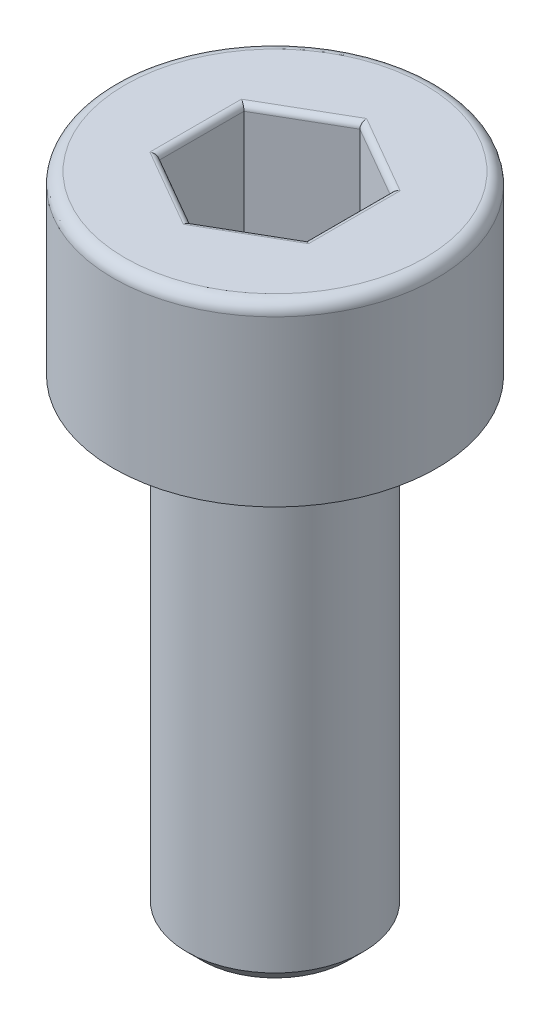
ISO-10303-21;
HEADER;
FILE_DESCRIPTION(('STEP AP214'),'2;1');
FILE_NAME('part.step','',(''),(''),'','','');
FILE_SCHEMA(('AUTOMOTIVE_DESIGN { 1 0 10303 214 1 1 1 1 }'));
ENDSEC;
DATA;
#1=APPLICATION_CONTEXT('core data for automotive mechanical design processes');
#2=APPLICATION_PROTOCOL_DEFINITION('international standard','automotive_design',2000,#1);
#3=PRODUCT_CONTEXT('',#1,'mechanical');
#4=PRODUCT('Part','Part','',(#3));
#5=PRODUCT_RELATED_PRODUCT_CATEGORY('part','',(#4));
#6=PRODUCT_DEFINITION_FORMATION('','',#4);
#7=PRODUCT_DEFINITION_CONTEXT('part definition',#1,'design');
#8=PRODUCT_DEFINITION('design','',#6,#7);
#9=PRODUCT_DEFINITION_SHAPE('','',#8);
#10=(LENGTH_UNIT() NAMED_UNIT(*) SI_UNIT(.MILLI.,.METRE.));
#11=(NAMED_UNIT(*) PLANE_ANGLE_UNIT() SI_UNIT($,.RADIAN.));
#12=(NAMED_UNIT(*) SI_UNIT($,.STERADIAN.) SOLID_ANGLE_UNIT());
#13=UNCERTAINTY_MEASURE_WITH_UNIT(LENGTH_MEASURE(1.E-05),#10,'distance_accuracy_value','');
#14=(GEOMETRIC_REPRESENTATION_CONTEXT(3) GLOBAL_UNCERTAINTY_ASSIGNED_CONTEXT((#13)) GLOBAL_UNIT_ASSIGNED_CONTEXT((#10,
#11,#12)) REPRESENTATION_CONTEXT('',''));
#15=CARTESIAN_POINT('',(0.,0.,0.));
#16=DIRECTION('',(0.,0.,1.));
#17=DIRECTION('',(1.,0.,0.));
#18=AXIS2_PLACEMENT_3D('',#15,#16,#17);
#19=CARTESIAN_POINT('',(0.,-11.,0.));
#20=DIRECTION('',(0.,-1.,0.));
#21=DIRECTION('',(0.,0.,-1.));
#22=AXIS2_PLACEMENT_3D('',#19,#20,#21);
#23=PLANE('',#22);
#24=CARTESIAN_POINT('',(0.,-11.,0.));
#25=DIRECTION('',(0.,-1.,0.));
#26=DIRECTION('',(0.,0.,-1.));
#27=AXIS2_PLACEMENT_3D('',#24,#25,#26);
#28=CIRCLE('',#27,1.25);
#29=CARTESIAN_POINT('',(0.,-11.,-1.25));
#30=VERTEX_POINT('',#29);
#31=EDGE_CURVE('E263',#30,#30,#28,.T.);
#32=ORIENTED_EDGE('',*,*,#31,.T.);
#33=EDGE_LOOP('',(#32));
#34=FACE_BOUND('',#33,.T.);
#35=ADVANCED_FACE('F35',(#34),#23,.T.);
#36=CARTESIAN_POINT('',(0.,0.,0.));
#37=DIRECTION('',(0.,1.,0.));
#38=DIRECTION('',(0.,0.,1.));
#39=AXIS2_PLACEMENT_3D('',#36,#37,#38);
#40=CYLINDRICAL_SURFACE('',#39,1.5);
#41=CARTESIAN_POINT('',(0.,-3.25,0.));
#42=DIRECTION('',(0.,-1.,0.));
#43=DIRECTION('',(0.,0.,-1.));
#44=AXIS2_PLACEMENT_3D('',#41,#42,#43);
#45=CIRCLE('',#44,1.5);
#46=CARTESIAN_POINT('',(0.,-3.25,-1.5));
#47=VERTEX_POINT('',#46);
#48=EDGE_CURVE('E260',#47,#47,#45,.T.);
#49=ORIENTED_EDGE('',*,*,#48,.T.);
#50=EDGE_LOOP('',(#49));
#51=FACE_BOUND('',#50,.T.);
#52=CARTESIAN_POINT('',(0.,-10.75,0.));
#53=DIRECTION('',(0.,-1.,0.));
#54=DIRECTION('',(0.,0.,-1.));
#55=AXIS2_PLACEMENT_3D('',#52,#53,#54);
#56=CIRCLE('',#55,1.5);
#57=CARTESIAN_POINT('',(0.,-10.75,-1.5));
#58=VERTEX_POINT('',#57);
#59=EDGE_CURVE('E257',#58,#58,#56,.F.);
#60=ORIENTED_EDGE('',*,*,#59,.T.);
#61=EDGE_LOOP('',(#60));
#62=FACE_BOUND('',#61,.T.);
#63=ADVANCED_FACE('F289',(#51,#62),#40,.T.);
#64=CARTESIAN_POINT('',(-1.5,-3.,0.));
#65=DIRECTION('',(0.,-1.,0.));
#66=DIRECTION('',(0.,0.,-1.));
#67=AXIS2_PLACEMENT_3D('',#64,#65,#66);
#68=PLANE('',#67);
#69=CARTESIAN_POINT('',(0.,-3.,0.));
#70=DIRECTION('',(0.,-1.,0.));
#71=DIRECTION('',(0.,0.,-1.));
#72=AXIS2_PLACEMENT_3D('',#69,#70,#71);
#73=CIRCLE('',#72,1.75);
#74=CARTESIAN_POINT('',(0.,-3.,-1.75));
#75=VERTEX_POINT('',#74);
#76=EDGE_CURVE('E254',#75,#75,#73,.F.);
#77=ORIENTED_EDGE('',*,*,#76,.T.);
#78=EDGE_LOOP('',(#77));
#79=FACE_BOUND('',#78,.T.);
#80=CARTESIAN_POINT('',(0.,-3.,0.));
#81=DIRECTION('',(0.,1.,0.));
#82=DIRECTION('',(0.,0.,1.));
#83=AXIS2_PLACEMENT_3D('',#80,#81,#82);
#84=CIRCLE('',#83,2.75);
#85=CARTESIAN_POINT('',(0.,-3.,2.75));
#86=VERTEX_POINT('',#85);
#87=EDGE_CURVE('E251',#86,#86,#84,.T.);
#88=ORIENTED_EDGE('',*,*,#87,.F.);
#89=EDGE_LOOP('',(#88));
#90=FACE_BOUND('',#89,.T.);
#91=ADVANCED_FACE('F295',(#79,#90),#68,.T.);
#92=CARTESIAN_POINT('',(0.,0.,0.));
#93=DIRECTION('',(0.,1.,0.));
#94=DIRECTION('',(0.,0.,1.));
#95=AXIS2_PLACEMENT_3D('',#92,#93,#94);
#96=CYLINDRICAL_SURFACE('',#95,2.75);
#97=CARTESIAN_POINT('',(0.,-0.2,0.));
#98=DIRECTION('',(0.,1.,0.));
#99=DIRECTION('',(0.,0.,1.));
#100=AXIS2_PLACEMENT_3D('',#97,#98,#99);
#101=CIRCLE('',#100,2.75);
#102=CARTESIAN_POINT('',(0.,-0.2,2.75));
#103=VERTEX_POINT('',#102);
#104=EDGE_CURVE('E161',#103,#103,#101,.F.);
#105=ORIENTED_EDGE('',*,*,#104,.T.);
#106=EDGE_LOOP('',(#105));
#107=FACE_BOUND('',#106,.T.);
#108=ORIENTED_EDGE('',*,*,#87,.T.);
#109=EDGE_LOOP('',(#108));
#110=FACE_BOUND('',#109,.T.);
#111=ADVANCED_FACE('F305',(#107,#110),#96,.T.);
#112=CARTESIAN_POINT('',(-2.75,0.,0.));
#113=DIRECTION('',(0.,1.,0.));
#114=DIRECTION('',(0.,0.,1.));
#115=AXIS2_PLACEMENT_3D('',#112,#113,#114);
#116=PLANE('',#115);
#117=DIRECTION('',(0.,0.,1.));
#118=VECTOR('',#117,1.);
#119=CARTESIAN_POINT('',(-1.35,0.,-0.721687836487033));
#120=LINE('',#119,#118);
#121=CARTESIAN_POINT('',(-1.35,0.,0.779422863405995));
#122=VERTEX_POINT('',#121);
#123=CARTESIAN_POINT('',(-1.35,0.,-0.779422863405995));
#124=VERTEX_POINT('',#123);
#125=EDGE_CURVE('E177',#122,#124,#120,.F.);
#126=ORIENTED_EDGE('',*,*,#125,.T.);
#127=DIRECTION('',(-0.866025403784439,0.,0.5));
#128=VECTOR('',#127,1.);
#129=CARTESIAN_POINT('',(-0.0500000000000002,0.,-1.52997821335251));
#130=LINE('',#129,#128);
#131=CARTESIAN_POINT('',(0.,0.,-1.55884572681199));
#132=VERTEX_POINT('',#131);
#133=EDGE_CURVE('E136',#124,#132,#130,.F.);
#134=ORIENTED_EDGE('',*,*,#133,.T.);
#135=DIRECTION('',(-0.866025403784439,0.,-0.5));
#136=VECTOR('',#135,1.);
#137=CARTESIAN_POINT('',(1.3,0.,-0.808290376865477));
#138=LINE('',#137,#136);
#139=CARTESIAN_POINT('',(1.35,0.,-0.779422863405995));
#140=VERTEX_POINT('',#139);
#141=EDGE_CURVE('E163',#132,#140,#138,.F.);
#142=ORIENTED_EDGE('',*,*,#141,.T.);
#143=DIRECTION('',(0.,0.,-1.));
#144=VECTOR('',#143,1.);
#145=CARTESIAN_POINT('',(1.35,0.,0.721687836487034));
#146=LINE('',#145,#144);
#147=CARTESIAN_POINT('',(1.35,0.,0.779422863405996));
#148=VERTEX_POINT('',#147);
#149=EDGE_CURVE('E171',#140,#148,#146,.F.);
#150=ORIENTED_EDGE('',*,*,#149,.T.);
#151=DIRECTION('',(0.866025403784439,0.,-0.5));
#152=VECTOR('',#151,1.);
#153=CARTESIAN_POINT('',(0.05,0.,1.52997821335251));
#154=LINE('',#153,#152);
#155=CARTESIAN_POINT('',(0.,0.,1.55884572681199));
#156=VERTEX_POINT('',#155);
#157=EDGE_CURVE('E173',#148,#156,#154,.F.);
#158=ORIENTED_EDGE('',*,*,#157,.T.);
#159=DIRECTION('',(0.866025403784438,0.,0.5));
#160=VECTOR('',#159,1.);
#161=CARTESIAN_POINT('',(-1.3,0.,0.808290376865476));
#162=LINE('',#161,#160);
#163=EDGE_CURVE('E175',#156,#122,#162,.F.);
#164=ORIENTED_EDGE('',*,*,#163,.T.);
#165=EDGE_LOOP('',(#126,#134,#142,#150,#158,#164));
#166=FACE_BOUND('',#165,.T.);
#167=CARTESIAN_POINT('',(0.,0.,0.));
#168=DIRECTION('',(0.,1.,0.));
#169=DIRECTION('',(0.,0.,1.));
#170=AXIS2_PLACEMENT_3D('',#167,#168,#169);
#171=CIRCLE('',#170,2.55);
#172=CARTESIAN_POINT('',(0.,0.,2.55));
#173=VERTEX_POINT('',#172);
#174=EDGE_CURVE('E166',#173,#173,#171,.T.);
#175=ORIENTED_EDGE('',*,*,#174,.T.);
#176=EDGE_LOOP('',(#175));
#177=FACE_BOUND('',#176,.T.);
#178=ADVANCED_FACE('F268',(#166,#177),#116,.T.);
#179=CARTESIAN_POINT('',(0.,-3.,0.));
#180=DIRECTION('',(0.,1.,0.));
#181=DIRECTION('',(0.,0.,1.));
#182=AXIS2_PLACEMENT_3D('',#179,#180,#181);
#183=CONICAL_SURFACE('',#182,1.75,0.785398163397455);
#184=ORIENTED_EDGE('',*,*,#48,.F.);
#185=EDGE_LOOP('',(#184));
#186=FACE_BOUND('',#185,.T.);
#187=ORIENTED_EDGE('',*,*,#76,.F.);
#188=EDGE_LOOP('',(#187));
#189=FACE_BOUND('',#188,.T.);
#190=ADVANCED_FACE('F283',(#186,#189),#183,.T.);
#191=CARTESIAN_POINT('',(0.,-10.75,0.));
#192=DIRECTION('',(0.,1.,0.));
#193=DIRECTION('',(0.,0.,1.));
#194=AXIS2_PLACEMENT_3D('',#191,#192,#193);
#195=CONICAL_SURFACE('',#194,1.5,0.785398163397451);
#196=ORIENTED_EDGE('',*,*,#31,.F.);
#197=EDGE_LOOP('',(#196));
#198=FACE_BOUND('',#197,.T.);
#199=ORIENTED_EDGE('',*,*,#59,.F.);
#200=EDGE_LOOP('',(#199));
#201=FACE_BOUND('',#200,.T.);
#202=ADVANCED_FACE('F273',(#198,#201),#195,.T.);
#203=CARTESIAN_POINT('',(0.,-0.2,0.));
#204=DIRECTION('',(0.,1.,0.));
#205=DIRECTION('',(0.,0.,1.));
#206=AXIS2_PLACEMENT_3D('',#203,#204,#205);
#207=TOROIDAL_SURFACE('',#206,2.55,0.2);
#208=ORIENTED_EDGE('',*,*,#104,.F.);
#209=EDGE_LOOP('',(#208));
#210=FACE_BOUND('',#209,.T.);
#211=ORIENTED_EDGE('',*,*,#174,.F.);
#212=EDGE_LOOP('',(#211));
#213=FACE_BOUND('',#212,.T.);
#214=ADVANCED_FACE('F270',(#210,#213),#207,.T.);
#215=CARTESIAN_POINT('',(1.25,-2.,-0.721687836487033));
#216=DIRECTION('',(0.5,0.,-0.866025403784439));
#217=DIRECTION('',(-0.866025403784439,0.,-0.5));
#218=AXIS2_PLACEMENT_3D('',#215,#216,#217);
#219=PLANE('',#218);
#220=DIRECTION('',(0.,1.,0.));
#221=VECTOR('',#220,1.);
#222=CARTESIAN_POINT('',(1.25,-2.,-0.721687836487033));
#223=LINE('',#222,#221);
#224=CARTESIAN_POINT('',(1.25,-1.9,-0.721687836487033));
#225=VERTEX_POINT('',#224);
#226=CARTESIAN_POINT('',(1.25,-0.1,-0.721687836487033));
#227=VERTEX_POINT('',#226);
#228=EDGE_CURVE('E245',#225,#227,#223,.T.);
#229=ORIENTED_EDGE('',*,*,#228,.T.);
#230=DIRECTION('',(-0.866025403784439,0.,-0.5));
#231=VECTOR('',#230,1.);
#232=CARTESIAN_POINT('',(0.,-0.1,-1.44337567297406));
#233=LINE('',#232,#231);
#234=CARTESIAN_POINT('',(0.,-0.1,-1.44337567297406));
#235=VERTEX_POINT('',#234);
#236=EDGE_CURVE('E197',#227,#235,#233,.T.);
#237=ORIENTED_EDGE('',*,*,#236,.T.);
#238=DIRECTION('',(0.,1.,0.));
#239=VECTOR('',#238,1.);
#240=CARTESIAN_POINT('',(0.,-2.,-1.44337567297406));
#241=LINE('',#240,#239);
#242=CARTESIAN_POINT('',(0.,-1.9,-1.44337567297406));
#243=VERTEX_POINT('',#242);
#244=EDGE_CURVE('E147',#243,#235,#241,.T.);
#245=ORIENTED_EDGE('',*,*,#244,.F.);
#246=DIRECTION('',(-0.866025403784439,0.,-0.5));
#247=VECTOR('',#246,1.);
#248=CARTESIAN_POINT('',(1.25,-1.9,-0.721687836487033));
#249=LINE('',#248,#247);
#250=EDGE_CURVE('E195',#243,#225,#249,.F.);
#251=ORIENTED_EDGE('',*,*,#250,.T.);
#252=EDGE_LOOP('',(#229,#237,#245,#251));
#253=FACE_BOUND('',#252,.T.);
#254=ADVANCED_FACE('F272',(#253),#219,.F.);
#255=CARTESIAN_POINT('',(1.25,-2.,0.721687836487034));
#256=DIRECTION('',(1.,0.,0.));
#257=DIRECTION('',(0.,0.,-1.));
#258=AXIS2_PLACEMENT_3D('',#255,#256,#257);
#259=PLANE('',#258);
#260=DIRECTION('',(0.,1.,0.));
#261=VECTOR('',#260,1.);
#262=CARTESIAN_POINT('',(1.25,-2.,0.721687836487034));
#263=LINE('',#262,#261);
#264=CARTESIAN_POINT('',(1.25,-1.9,0.721687836487034));
#265=VERTEX_POINT('',#264);
#266=CARTESIAN_POINT('',(1.25,-0.1,0.721687836487034));
#267=VERTEX_POINT('',#266);
#268=EDGE_CURVE('E242',#265,#267,#263,.T.);
#269=ORIENTED_EDGE('',*,*,#268,.T.);
#270=DIRECTION('',(0.,0.,-1.));
#271=VECTOR('',#270,1.);
#272=CARTESIAN_POINT('',(1.25,-0.1,-0.721687836487033));
#273=LINE('',#272,#271);
#274=EDGE_CURVE('E193',#267,#227,#273,.T.);
#275=ORIENTED_EDGE('',*,*,#274,.T.);
#276=ORIENTED_EDGE('',*,*,#228,.F.);
#277=DIRECTION('',(0.,0.,-1.));
#278=VECTOR('',#277,1.);
#279=CARTESIAN_POINT('',(1.25,-1.9,0.721687836487034));
#280=LINE('',#279,#278);
#281=EDGE_CURVE('E190',#225,#265,#280,.F.);
#282=ORIENTED_EDGE('',*,*,#281,.T.);
#283=EDGE_LOOP('',(#269,#275,#276,#282));
#284=FACE_BOUND('',#283,.T.);
#285=ADVANCED_FACE('F280',(#284),#259,.F.);
#286=CARTESIAN_POINT('',(0.,-2.,1.44337567297407));
#287=DIRECTION('',(0.5,0.,0.866025403784439));
#288=DIRECTION('',(0.866025403784439,0.,-0.5));
#289=AXIS2_PLACEMENT_3D('',#286,#287,#288);
#290=PLANE('',#289);
#291=DIRECTION('',(0.,1.,0.));
#292=VECTOR('',#291,1.);
#293=CARTESIAN_POINT('',(0.,-2.,1.44337567297407));
#294=LINE('',#293,#292);
#295=CARTESIAN_POINT('',(0.,-1.9,1.44337567297407));
#296=VERTEX_POINT('',#295);
#297=CARTESIAN_POINT('',(0.,-0.1,1.44337567297407));
#298=VERTEX_POINT('',#297);
#299=EDGE_CURVE('E239',#296,#298,#294,.T.);
#300=ORIENTED_EDGE('',*,*,#299,.T.);
#301=DIRECTION('',(0.866025403784439,0.,-0.5));
#302=VECTOR('',#301,1.);
#303=CARTESIAN_POINT('',(1.25,-0.1,0.721687836487034));
#304=LINE('',#303,#302);
#305=EDGE_CURVE('E188',#298,#267,#304,.T.);
#306=ORIENTED_EDGE('',*,*,#305,.T.);
#307=ORIENTED_EDGE('',*,*,#268,.F.);
#308=DIRECTION('',(0.866025403784439,0.,-0.5));
#309=VECTOR('',#308,1.);
#310=CARTESIAN_POINT('',(0.,-1.9,1.44337567297407));
#311=LINE('',#310,#309);
#312=EDGE_CURVE('E186',#265,#296,#311,.F.);
#313=ORIENTED_EDGE('',*,*,#312,.T.);
#314=EDGE_LOOP('',(#300,#306,#307,#313));
#315=FACE_BOUND('',#314,.T.);
#316=ADVANCED_FACE('F329',(#315),#290,.F.);
#317=CARTESIAN_POINT('',(-1.25,-2.,0.721687836487033));
#318=DIRECTION('',(-0.5,0.,0.866025403784439));
#319=DIRECTION('',(0.866025403784438,0.,0.5));
#320=AXIS2_PLACEMENT_3D('',#317,#318,#319);
#321=PLANE('',#320);
#322=DIRECTION('',(0.,1.,0.));
#323=VECTOR('',#322,1.);
#324=CARTESIAN_POINT('',(-1.25,-2.,0.721687836487033));
#325=LINE('',#324,#323);
#326=CARTESIAN_POINT('',(-1.25,-1.9,0.721687836487033));
#327=VERTEX_POINT('',#326);
#328=CARTESIAN_POINT('',(-1.25,-0.1,0.721687836487033));
#329=VERTEX_POINT('',#328);
#330=EDGE_CURVE('E130',#327,#329,#325,.T.);
#331=ORIENTED_EDGE('',*,*,#330,.T.);
#332=DIRECTION('',(0.866025403784438,0.,0.5));
#333=VECTOR('',#332,1.);
#334=CARTESIAN_POINT('',(0.,-0.1,1.44337567297407));
#335=LINE('',#334,#333);
#336=EDGE_CURVE('E184',#329,#298,#335,.T.);
#337=ORIENTED_EDGE('',*,*,#336,.T.);
#338=ORIENTED_EDGE('',*,*,#299,.F.);
#339=DIRECTION('',(0.866025403784438,0.,0.5));
#340=VECTOR('',#339,1.);
#341=CARTESIAN_POINT('',(-1.25,-1.9,0.721687836487033));
#342=LINE('',#341,#340);
#343=EDGE_CURVE('E182',#296,#327,#342,.F.);
#344=ORIENTED_EDGE('',*,*,#343,.T.);
#345=EDGE_LOOP('',(#331,#337,#338,#344));
#346=FACE_BOUND('',#345,.T.);
#347=ADVANCED_FACE('F236',(#346),#321,.F.);
#348=CARTESIAN_POINT('',(-1.25,-2.,-0.721687836487033));
#349=DIRECTION('',(-1.,0.,0.));
#350=DIRECTION('',(0.,0.,1.));
#351=AXIS2_PLACEMENT_3D('',#348,#349,#350);
#352=PLANE('',#351);
#353=DIRECTION('',(0.,1.,0.));
#354=VECTOR('',#353,1.);
#355=CARTESIAN_POINT('',(-1.25,-2.,-0.721687836487033));
#356=LINE('',#355,#354);
#357=CARTESIAN_POINT('',(-1.25,-1.9,-0.721687836487033));
#358=VERTEX_POINT('',#357);
#359=CARTESIAN_POINT('',(-1.25,-0.1,-0.721687836487033));
#360=VERTEX_POINT('',#359);
#361=EDGE_CURVE('E128',#358,#360,#356,.T.);
#362=ORIENTED_EDGE('',*,*,#361,.T.);
#363=DIRECTION('',(0.,0.,1.));
#364=VECTOR('',#363,1.);
#365=CARTESIAN_POINT('',(-1.25,-0.1,0.721687836487033));
#366=LINE('',#365,#364);
#367=EDGE_CURVE('E135',#360,#329,#366,.T.);
#368=ORIENTED_EDGE('',*,*,#367,.T.);
#369=ORIENTED_EDGE('',*,*,#330,.F.);
#370=DIRECTION('',(0.,0.,1.));
#371=VECTOR('',#370,1.);
#372=CARTESIAN_POINT('',(-1.25,-1.9,-0.721687836487033));
#373=LINE('',#372,#371);
#374=EDGE_CURVE('E125',#327,#358,#373,.F.);
#375=ORIENTED_EDGE('',*,*,#374,.T.);
#376=EDGE_LOOP('',(#362,#368,#369,#375));
#377=FACE_BOUND('',#376,.T.);
#378=ADVANCED_FACE('F127',(#377),#352,.F.);
#379=CARTESIAN_POINT('',(0.,-2.,-1.44337567297406));
#380=DIRECTION('',(-0.5,0.,-0.866025403784439));
#381=DIRECTION('',(-0.866025403784439,0.,0.5));
#382=AXIS2_PLACEMENT_3D('',#379,#380,#381);
#383=PLANE('',#382);
#384=ORIENTED_EDGE('',*,*,#244,.T.);
#385=DIRECTION('',(-0.866025403784439,0.,0.5));
#386=VECTOR('',#385,1.);
#387=CARTESIAN_POINT('',(-1.25,-0.1,-0.721687836487032));
#388=LINE('',#387,#386);
#389=EDGE_CURVE('E146',#235,#360,#388,.T.);
#390=ORIENTED_EDGE('',*,*,#389,.T.);
#391=ORIENTED_EDGE('',*,*,#361,.F.);
#392=DIRECTION('',(-0.866025403784439,0.,0.5));
#393=VECTOR('',#392,1.);
#394=CARTESIAN_POINT('',(0.,-1.9,-1.44337567297406));
#395=LINE('',#394,#393);
#396=EDGE_CURVE('E143',#358,#243,#395,.F.);
#397=ORIENTED_EDGE('',*,*,#396,.T.);
#398=EDGE_LOOP('',(#384,#390,#391,#397));
#399=FACE_BOUND('',#398,.T.);
#400=ADVANCED_FACE('F141',(#399),#383,.F.);
#401=CARTESIAN_POINT('',(1.25,-2.,-0.721687836487033));
#402=DIRECTION('',(0.,-1.,0.));
#403=DIRECTION('',(0.,0.,-1.));
#404=AXIS2_PLACEMENT_3D('',#401,#402,#403);
#405=PLANE('',#404);
#406=DIRECTION('',(0.866025403784439,0.,-0.5));
#407=VECTOR('',#406,1.);
#408=CARTESIAN_POINT('',(1.2,-2.,0.63508529610859));
#409=LINE('',#408,#407);
#410=CARTESIAN_POINT('',(0.,-2.,1.32790561913614));
#411=VERTEX_POINT('',#410);
#412=CARTESIAN_POINT('',(1.15,-2.,0.663952809568071));
#413=VERTEX_POINT('',#412);
#414=EDGE_CURVE('E44',#411,#413,#409,.T.);
#415=ORIENTED_EDGE('',*,*,#414,.T.);
#416=DIRECTION('',(0.,0.,-1.));
#417=VECTOR('',#416,1.);
#418=CARTESIAN_POINT('',(1.15,-2.,-0.721687836487033));
#419=LINE('',#418,#417);
#420=CARTESIAN_POINT('',(1.15,-2.,-0.66395280956807));
#421=VERTEX_POINT('',#420);
#422=EDGE_CURVE('E11',#413,#421,#419,.T.);
#423=ORIENTED_EDGE('',*,*,#422,.T.);
#424=DIRECTION('',(-0.866025403784439,0.,-0.5));
#425=VECTOR('',#424,1.);
#426=CARTESIAN_POINT('',(-0.0500000000000001,-2.,-1.35677313259562));
#427=LINE('',#426,#425);
#428=CARTESIAN_POINT('',(0.,-2.,-1.32790561913614));
#429=VERTEX_POINT('',#428);
#430=EDGE_CURVE('E199',#421,#429,#427,.T.);
#431=ORIENTED_EDGE('',*,*,#430,.T.);
#432=DIRECTION('',(-0.866025403784439,0.,0.5));
#433=VECTOR('',#432,1.);
#434=CARTESIAN_POINT('',(-1.2,-2.,-0.635085296108588));
#435=LINE('',#434,#433);
#436=CARTESIAN_POINT('',(-1.15,-2.,-0.66395280956807));
#437=VERTEX_POINT('',#436);
#438=EDGE_CURVE('E201',#429,#437,#435,.T.);
#439=ORIENTED_EDGE('',*,*,#438,.T.);
#440=DIRECTION('',(0.,0.,1.));
#441=VECTOR('',#440,1.);
#442=CARTESIAN_POINT('',(-1.15,-2.,0.721687836487033));
#443=LINE('',#442,#441);
#444=CARTESIAN_POINT('',(-1.15,-2.,0.66395280956807));
#445=VERTEX_POINT('',#444);
#446=EDGE_CURVE('E152',#437,#445,#443,.T.);
#447=ORIENTED_EDGE('',*,*,#446,.T.);
#448=DIRECTION('',(0.866025403784438,0.,0.5));
#449=VECTOR('',#448,1.);
#450=CARTESIAN_POINT('',(0.0499999999999999,-2.,1.35677313259562));
#451=LINE('',#450,#449);
#452=EDGE_CURVE('E55',#445,#411,#451,.T.);
#453=ORIENTED_EDGE('',*,*,#452,.T.);
#454=EDGE_LOOP('',(#415,#423,#431,#439,#447,#453));
#455=FACE_BOUND('',#454,.T.);
#456=ADVANCED_FACE('F324',(#455),#405,.F.);
#457=CARTESIAN_POINT('',(0.05,-0.1,1.52997821335251));
#458=DIRECTION('',(-0.866025403784439,0.,0.5));
#459=DIRECTION('',(0.5,0.,0.866025403784439));
#460=AXIS2_PLACEMENT_3D('',#457,#458,#459);
#461=CYLINDRICAL_SURFACE('',#460,0.1);
#462=CARTESIAN_POINT('',(0.,-0.1,1.55884572681199));
#463=DIRECTION('',(-1.,0.,0.));
#464=DIRECTION('',(0.,0.,-1.));
#465=AXIS2_PLACEMENT_3D('',#462,#463,#464);
#466=ELLIPSE('',#465,0.115470053837925,0.1);
#467=EDGE_CURVE('E216',#156,#298,#466,.T.);
#468=ORIENTED_EDGE('',*,*,#467,.F.);
#469=ORIENTED_EDGE('',*,*,#157,.F.);
#470=CARTESIAN_POINT('',(1.35,-0.1,0.779422863405997));
#471=DIRECTION('',(-0.5,0.,0.866025403784438));
#472=DIRECTION('',(-0.866025403784438,0.,-0.5));
#473=AXIS2_PLACEMENT_3D('',#470,#471,#472);
#474=ELLIPSE('',#473,0.115470053837925,0.1);
#475=EDGE_CURVE('E219',#267,#148,#474,.F.);
#476=ORIENTED_EDGE('',*,*,#475,.F.);
#477=ORIENTED_EDGE('',*,*,#305,.F.);
#478=EDGE_LOOP('',(#468,#469,#476,#477));
#479=FACE_BOUND('',#478,.T.);
#480=ADVANCED_FACE('F336',(#479),#461,.T.);
#481=CARTESIAN_POINT('',(1.35,-0.1,0.721687836487034));
#482=DIRECTION('',(0.,0.,1.));
#483=DIRECTION('',(1.,0.,0.));
#484=AXIS2_PLACEMENT_3D('',#481,#482,#483);
#485=CYLINDRICAL_SURFACE('',#484,0.1);
#486=ORIENTED_EDGE('',*,*,#475,.T.);
#487=ORIENTED_EDGE('',*,*,#149,.F.);
#488=CARTESIAN_POINT('',(1.35,-0.1,-0.779422863405995));
#489=DIRECTION('',(0.5,0.,0.866025403784439));
#490=DIRECTION('',(-0.866025403784439,0.,0.5));
#491=AXIS2_PLACEMENT_3D('',#488,#489,#490);
#492=ELLIPSE('',#491,0.115470053837925,0.1);
#493=EDGE_CURVE('E213',#227,#140,#492,.F.);
#494=ORIENTED_EDGE('',*,*,#493,.F.);
#495=ORIENTED_EDGE('',*,*,#274,.F.);
#496=EDGE_LOOP('',(#486,#487,#494,#495));
#497=FACE_BOUND('',#496,.T.);
#498=ADVANCED_FACE('F340',(#497),#485,.T.);
#499=CARTESIAN_POINT('',(-1.3,-0.1,0.808290376865476));
#500=DIRECTION('',(-0.866025403784438,0.,-0.5));
#501=DIRECTION('',(-0.5,0.,0.866025403784439));
#502=AXIS2_PLACEMENT_3D('',#499,#500,#501);
#503=CYLINDRICAL_SURFACE('',#502,0.1);
#504=ORIENTED_EDGE('',*,*,#467,.T.);
#505=ORIENTED_EDGE('',*,*,#336,.F.);
#506=CARTESIAN_POINT('',(-1.35,-0.1,0.779422863405995));
#507=DIRECTION('',(-0.5,0.,-0.866025403784439));
#508=DIRECTION('',(0.866025403784439,0.,-0.5));
#509=AXIS2_PLACEMENT_3D('',#506,#507,#508);
#510=ELLIPSE('',#509,0.115470053837925,0.1);
#511=EDGE_CURVE('E210',#122,#329,#510,.T.);
#512=ORIENTED_EDGE('',*,*,#511,.F.);
#513=ORIENTED_EDGE('',*,*,#163,.F.);
#514=EDGE_LOOP('',(#504,#505,#512,#513));
#515=FACE_BOUND('',#514,.T.);
#516=ADVANCED_FACE('F346',(#515),#503,.T.);
#517=CARTESIAN_POINT('',(1.3,-0.1,-0.808290376865477));
#518=DIRECTION('',(0.866025403784439,0.,0.5));
#519=DIRECTION('',(0.5,0.,-0.866025403784439));
#520=AXIS2_PLACEMENT_3D('',#517,#518,#519);
#521=CYLINDRICAL_SURFACE('',#520,0.1);
#522=ORIENTED_EDGE('',*,*,#493,.T.);
#523=ORIENTED_EDGE('',*,*,#141,.F.);
#524=CARTESIAN_POINT('',(0.,-0.1,-1.55884572681199));
#525=DIRECTION('',(1.,0.,0.));
#526=DIRECTION('',(0.,0.,-1.));
#527=AXIS2_PLACEMENT_3D('',#524,#525,#526);
#528=ELLIPSE('',#527,0.115470053837925,0.1);
#529=EDGE_CURVE('E208',#235,#132,#528,.F.);
#530=ORIENTED_EDGE('',*,*,#529,.F.);
#531=ORIENTED_EDGE('',*,*,#236,.F.);
#532=EDGE_LOOP('',(#522,#523,#530,#531));
#533=FACE_BOUND('',#532,.T.);
#534=ADVANCED_FACE('F376',(#533),#521,.T.);
#535=CARTESIAN_POINT('',(-1.35,-0.1,-0.721687836487033));
#536=DIRECTION('',(0.,0.,-1.));
#537=DIRECTION('',(-1.,0.,0.));
#538=AXIS2_PLACEMENT_3D('',#535,#536,#537);
#539=CYLINDRICAL_SURFACE('',#538,0.1);
#540=ORIENTED_EDGE('',*,*,#511,.T.);
#541=ORIENTED_EDGE('',*,*,#367,.F.);
#542=CARTESIAN_POINT('',(-1.35,-0.1,-0.779422863405995));
#543=DIRECTION('',(0.5,0.,-0.866025403784439));
#544=DIRECTION('',(0.866025403784439,0.,0.5));
#545=AXIS2_PLACEMENT_3D('',#542,#543,#544);
#546=ELLIPSE('',#545,0.115470053837925,0.1);
#547=EDGE_CURVE('E206',#124,#360,#546,.T.);
#548=ORIENTED_EDGE('',*,*,#547,.F.);
#549=ORIENTED_EDGE('',*,*,#125,.F.);
#550=EDGE_LOOP('',(#540,#541,#548,#549));
#551=FACE_BOUND('',#550,.T.);
#552=ADVANCED_FACE('F371',(#551),#539,.T.);
#553=CARTESIAN_POINT('',(-0.05,-0.1,-1.52997821335251));
#554=DIRECTION('',(0.866025403784439,0.,-0.5));
#555=DIRECTION('',(-0.5,0.,-0.866025403784439));
#556=AXIS2_PLACEMENT_3D('',#553,#554,#555);
#557=CYLINDRICAL_SURFACE('',#556,0.1);
#558=ORIENTED_EDGE('',*,*,#529,.T.);
#559=ORIENTED_EDGE('',*,*,#133,.F.);
#560=ORIENTED_EDGE('',*,*,#547,.T.);
#561=ORIENTED_EDGE('',*,*,#389,.F.);
#562=EDGE_LOOP('',(#558,#559,#560,#561));
#563=FACE_BOUND('',#562,.T.);
#564=ADVANCED_FACE('F367',(#563),#557,.T.);
#565=CARTESIAN_POINT('',(-1.15,-1.9,-0.721687836487033));
#566=DIRECTION('',(0.,0.,-1.));
#567=DIRECTION('',(-1.,0.,0.));
#568=AXIS2_PLACEMENT_3D('',#565,#566,#567);
#569=CYLINDRICAL_SURFACE('',#568,0.1);
#570=CARTESIAN_POINT('',(-1.15,-1.9,-0.663952809568069));
#571=DIRECTION('',(0.5,0.,-0.866025403784439));
#572=DIRECTION('',(-0.866025403784439,0.,-0.5));
#573=AXIS2_PLACEMENT_3D('',#570,#571,#572);
#574=ELLIPSE('',#573,0.115470053837925,0.1);
#575=EDGE_CURVE('E151',#358,#437,#574,.F.);
#576=ORIENTED_EDGE('',*,*,#575,.F.);
#577=ORIENTED_EDGE('',*,*,#374,.F.);
#578=CARTESIAN_POINT('',(-1.15,-1.9,0.66395280956807));
#579=DIRECTION('',(-0.5,0.,-0.866025403784439));
#580=DIRECTION('',(-0.866025403784439,0.,0.5));
#581=AXIS2_PLACEMENT_3D('',#578,#579,#580);
#582=ELLIPSE('',#581,0.115470053837925,0.1);
#583=EDGE_CURVE('E39',#445,#327,#582,.T.);
#584=ORIENTED_EDGE('',*,*,#583,.F.);
#585=ORIENTED_EDGE('',*,*,#446,.F.);
#586=EDGE_LOOP('',(#576,#577,#584,#585));
#587=FACE_BOUND('',#586,.T.);
#588=ADVANCED_FACE('F37',(#587),#569,.F.);
#589=CARTESIAN_POINT('',(0.0499999999999988,-1.9,1.35677313259562));
#590=DIRECTION('',(-0.866025403784438,0.,-0.5));
#591=DIRECTION('',(-0.5,0.,0.866025403784439));
#592=AXIS2_PLACEMENT_3D('',#589,#590,#591);
#593=CYLINDRICAL_SURFACE('',#592,0.1);
#594=ORIENTED_EDGE('',*,*,#583,.T.);
#595=ORIENTED_EDGE('',*,*,#343,.F.);
#596=CARTESIAN_POINT('',(0.,-1.9,1.32790561913614));
#597=DIRECTION('',(-1.,0.,0.));
#598=DIRECTION('',(0.,0.,1.));
#599=AXIS2_PLACEMENT_3D('',#596,#597,#598);
#600=ELLIPSE('',#599,0.115470053837925,0.1);
#601=EDGE_CURVE('E155',#411,#296,#600,.T.);
#602=ORIENTED_EDGE('',*,*,#601,.F.);
#603=ORIENTED_EDGE('',*,*,#452,.F.);
#604=EDGE_LOOP('',(#594,#595,#602,#603));
#605=FACE_BOUND('',#604,.T.);
#606=ADVANCED_FACE('F233',(#605),#593,.F.);
#607=CARTESIAN_POINT('',(0.675,-1.9,-1.71761705083914));
#608=DIRECTION('',(0.866025403784439,0.,-0.5));
#609=DIRECTION('',(-0.5,0.,-0.866025403784439));
#610=AXIS2_PLACEMENT_3D('',#607,#608,#609);
#611=CYLINDRICAL_SURFACE('',#610,0.1);
#612=ORIENTED_EDGE('',*,*,#575,.T.);
#613=ORIENTED_EDGE('',*,*,#438,.F.);
#614=CARTESIAN_POINT('',(0.,-1.9,-1.32790561913614));
#615=DIRECTION('',(1.,0.,0.));
#616=DIRECTION('',(0.,0.,-1.));
#617=AXIS2_PLACEMENT_3D('',#614,#615,#616);
#618=ELLIPSE('',#617,0.115470053837925,0.1);
#619=EDGE_CURVE('E159',#243,#429,#618,.F.);
#620=ORIENTED_EDGE('',*,*,#619,.F.);
#621=ORIENTED_EDGE('',*,*,#396,.F.);
#622=EDGE_LOOP('',(#612,#613,#620,#621));
#623=FACE_BOUND('',#622,.T.);
#624=ADVANCED_FACE('F157',(#623),#611,.F.);
#625=CARTESIAN_POINT('',(1.825,-1.9,0.274241377865074));
#626=DIRECTION('',(-0.866025403784439,0.,0.5));
#627=DIRECTION('',(0.5,0.,0.866025403784439));
#628=AXIS2_PLACEMENT_3D('',#625,#626,#627);
#629=CYLINDRICAL_SURFACE('',#628,0.1);
#630=ORIENTED_EDGE('',*,*,#601,.T.);
#631=ORIENTED_EDGE('',*,*,#312,.F.);
#632=CARTESIAN_POINT('',(1.15,-1.9,0.663952809568072));
#633=DIRECTION('',(-0.5,0.,0.866025403784438));
#634=DIRECTION('',(0.866025403784438,0.,0.5));
#635=AXIS2_PLACEMENT_3D('',#632,#633,#634);
#636=ELLIPSE('',#635,0.115470053837925,0.1);
#637=EDGE_CURVE('E224',#413,#265,#636,.T.);
#638=ORIENTED_EDGE('',*,*,#637,.F.);
#639=ORIENTED_EDGE('',*,*,#414,.F.);
#640=EDGE_LOOP('',(#630,#631,#638,#639));
#641=FACE_BOUND('',#640,.T.);
#642=ADVANCED_FACE('F230',(#641),#629,.F.);
#643=CARTESIAN_POINT('',(1.2,-1.9,-0.635085296108589));
#644=DIRECTION('',(0.866025403784439,0.,0.5));
#645=DIRECTION('',(0.5,0.,-0.866025403784439));
#646=AXIS2_PLACEMENT_3D('',#643,#644,#645);
#647=CYLINDRICAL_SURFACE('',#646,0.1);
#648=ORIENTED_EDGE('',*,*,#619,.T.);
#649=ORIENTED_EDGE('',*,*,#430,.F.);
#650=CARTESIAN_POINT('',(1.15,-1.9,-0.66395280956807));
#651=DIRECTION('',(0.5,0.,0.866025403784439));
#652=DIRECTION('',(-0.866025403784439,0.,0.5));
#653=AXIS2_PLACEMENT_3D('',#650,#651,#652);
#654=ELLIPSE('',#653,0.115470053837925,0.1);
#655=EDGE_CURVE('E222',#225,#421,#654,.F.);
#656=ORIENTED_EDGE('',*,*,#655,.F.);
#657=ORIENTED_EDGE('',*,*,#250,.F.);
#658=EDGE_LOOP('',(#648,#649,#656,#657));
#659=FACE_BOUND('',#658,.T.);
#660=ADVANCED_FACE('F355',(#659),#647,.F.);
#661=CARTESIAN_POINT('',(1.15,-1.9,-0.721687836487033));
#662=DIRECTION('',(0.,0.,1.));
#663=DIRECTION('',(1.,0.,0.));
#664=AXIS2_PLACEMENT_3D('',#661,#662,#663);
#665=CYLINDRICAL_SURFACE('',#664,0.1);
#666=ORIENTED_EDGE('',*,*,#637,.T.);
#667=ORIENTED_EDGE('',*,*,#281,.F.);
#668=ORIENTED_EDGE('',*,*,#655,.T.);
#669=ORIENTED_EDGE('',*,*,#422,.F.);
#670=EDGE_LOOP('',(#666,#667,#668,#669));
#671=FACE_BOUND('',#670,.T.);
#672=ADVANCED_FACE('F352',(#671),#665,.F.);
#673=CLOSED_SHELL('',(#35,#63,#91,#111,#178,#190,#202,#214,#254,#285,#316,#347,#378,#400,#456,
#480,#498,#516,#534,#552,#564,#588,#606,#624,#642,#660,#672));
#674=MANIFOLD_SOLID_BREP('B2',#673);
#675=ADVANCED_BREP_SHAPE_REPRESENTATION('',(#18,#674),#14);
#676=SHAPE_DEFINITION_REPRESENTATION(#9,#675);
ENDSEC;
END-ISO-10303-21;
